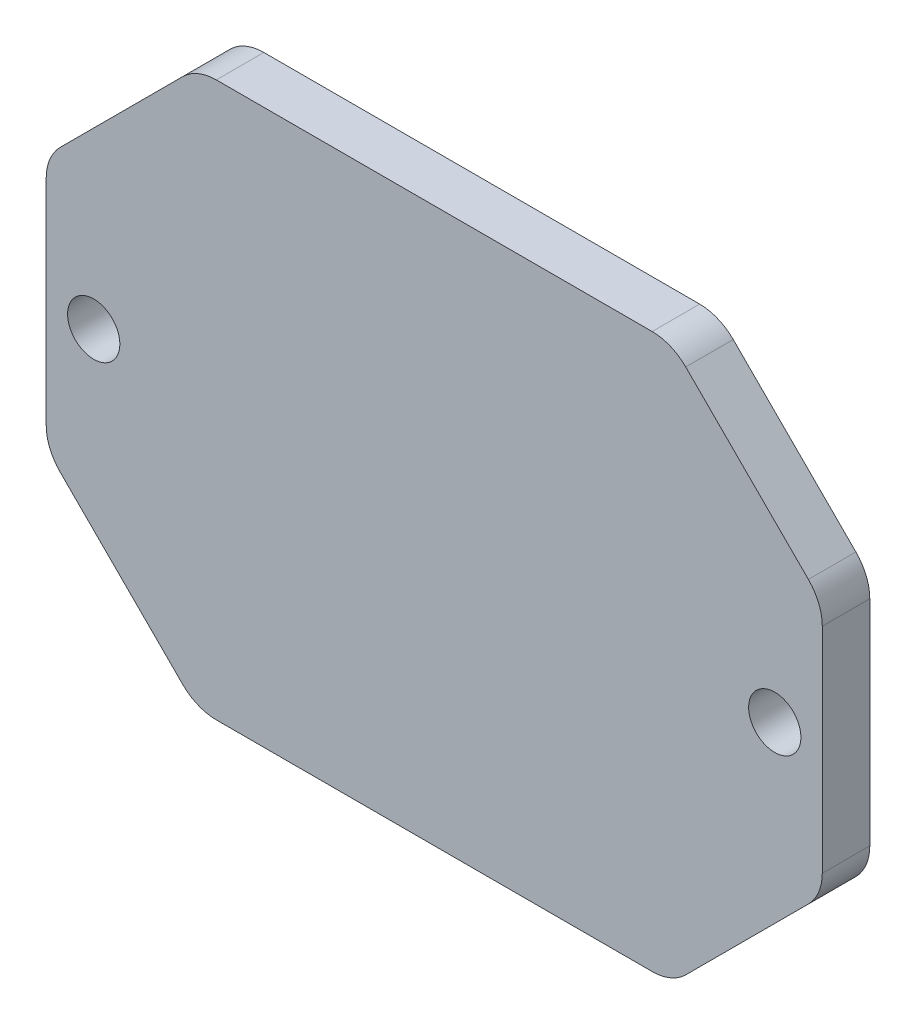
ISO-10303-21;
HEADER;
FILE_DESCRIPTION(('STEP AP214'),'2;1');
FILE_NAME('part.step','',(''),(''),'','','');
FILE_SCHEMA(('AUTOMOTIVE_DESIGN { 1 0 10303 214 1 1 1 1 }'));
ENDSEC;
DATA;
#1=APPLICATION_CONTEXT('core data for automotive mechanical design processes');
#2=APPLICATION_PROTOCOL_DEFINITION('international standard','automotive_design',2000,#1);
#3=PRODUCT_CONTEXT('',#1,'mechanical');
#4=PRODUCT('Part','Part','',(#3));
#5=PRODUCT_RELATED_PRODUCT_CATEGORY('part','',(#4));
#6=PRODUCT_DEFINITION_FORMATION('','',#4);
#7=PRODUCT_DEFINITION_CONTEXT('part definition',#1,'design');
#8=PRODUCT_DEFINITION('design','',#6,#7);
#9=PRODUCT_DEFINITION_SHAPE('','',#8);
#10=(LENGTH_UNIT() NAMED_UNIT(*) SI_UNIT(.MILLI.,.METRE.));
#11=(NAMED_UNIT(*) PLANE_ANGLE_UNIT() SI_UNIT($,.RADIAN.));
#12=(NAMED_UNIT(*) SI_UNIT($,.STERADIAN.) SOLID_ANGLE_UNIT());
#13=UNCERTAINTY_MEASURE_WITH_UNIT(LENGTH_MEASURE(1.E-05),#10,'distance_accuracy_value','');
#14=(GEOMETRIC_REPRESENTATION_CONTEXT(3) GLOBAL_UNCERTAINTY_ASSIGNED_CONTEXT((#13)) GLOBAL_UNIT_ASSIGNED_CONTEXT((#10,
#11,#12)) REPRESENTATION_CONTEXT('',''));
#15=CARTESIAN_POINT('',(0.,0.,0.));
#16=DIRECTION('',(0.,0.,1.));
#17=DIRECTION('',(1.,0.,0.));
#18=AXIS2_PLACEMENT_3D('',#15,#16,#17);
#19=CARTESIAN_POINT('',(24.5,17.4980916030534,3.));
#20=DIRECTION('',(-1.,0.,0.));
#21=DIRECTION('',(0.,-1.,0.));
#22=AXIS2_PLACEMENT_3D('',#19,#20,#21);
#23=PLANE('',#22);
#24=DIRECTION('',(0.,1.,0.));
#25=VECTOR('',#24,1.);
#26=CARTESIAN_POINT('',(24.5,17.4980916030534,3.));
#27=LINE('',#26,#25);
#28=CARTESIAN_POINT('',(24.5,-6.75545091593416,3.));
#29=VERTEX_POINT('',#28);
#30=CARTESIAN_POINT('',(24.5,6.75545091593414,3.));
#31=VERTEX_POINT('',#30);
#32=EDGE_CURVE('E269',#29,#31,#27,.T.);
#33=ORIENTED_EDGE('',*,*,#32,.F.);
#34=DIRECTION('',(0.,0.,1.));
#35=VECTOR('',#34,1.);
#36=CARTESIAN_POINT('',(24.5,-6.75545091593416,0.));
#37=LINE('',#36,#35);
#38=CARTESIAN_POINT('',(24.5,-6.75545091593416,0.));
#39=VERTEX_POINT('',#38);
#40=EDGE_CURVE('E224',#29,#39,#37,.F.);
#41=ORIENTED_EDGE('',*,*,#40,.T.);
#42=DIRECTION('',(0.,1.,0.));
#43=VECTOR('',#42,1.);
#44=CARTESIAN_POINT('',(24.5,17.4980916030534,0.));
#45=LINE('',#44,#43);
#46=CARTESIAN_POINT('',(24.5,6.75545091593414,0.));
#47=VERTEX_POINT('',#46);
#48=EDGE_CURVE('E291',#39,#47,#45,.T.);
#49=ORIENTED_EDGE('',*,*,#48,.T.);
#50=DIRECTION('',(0.,0.,-1.));
#51=VECTOR('',#50,1.);
#52=CARTESIAN_POINT('',(24.5,6.75545091593414,3.));
#53=LINE('',#52,#51);
#54=EDGE_CURVE('E221',#47,#31,#53,.F.);
#55=ORIENTED_EDGE('',*,*,#54,.T.);
#56=EDGE_LOOP('',(#33,#41,#49,#55));
#57=FACE_BOUND('',#56,.T.);
#58=ADVANCED_FACE('F36',(#57),#23,.F.);
#59=CARTESIAN_POINT('',(-24.5,17.4980916030534,3.));
#60=DIRECTION('',(0.,-1.,0.));
#61=DIRECTION('',(0.,0.,-1.));
#62=AXIS2_PLACEMENT_3D('',#59,#60,#61);
#63=PLANE('',#62);
#64=DIRECTION('',(-1.,0.,0.));
#65=VECTOR('',#64,1.);
#66=CARTESIAN_POINT('',(-24.5,17.4980916030534,3.));
#67=LINE('',#66,#65);
#68=CARTESIAN_POINT('',(13.7573593128807,17.4980916030534,3.));
#69=VERTEX_POINT('',#68);
#70=CARTESIAN_POINT('',(-13.7573593128807,17.4980916030534,3.));
#71=VERTEX_POINT('',#70);
#72=EDGE_CURVE('E173',#69,#71,#67,.T.);
#73=ORIENTED_EDGE('',*,*,#72,.F.);
#74=DIRECTION('',(0.,0.,1.));
#75=VECTOR('',#74,1.);
#76=CARTESIAN_POINT('',(13.7573593128807,17.4980916030534,0.));
#77=LINE('',#76,#75);
#78=CARTESIAN_POINT('',(13.7573593128807,17.4980916030534,0.));
#79=VERTEX_POINT('',#78);
#80=EDGE_CURVE('E234',#69,#79,#77,.F.);
#81=ORIENTED_EDGE('',*,*,#80,.T.);
#82=DIRECTION('',(-1.,0.,0.));
#83=VECTOR('',#82,1.);
#84=CARTESIAN_POINT('',(-24.5,17.4980916030534,0.));
#85=LINE('',#84,#83);
#86=CARTESIAN_POINT('',(-13.7573593128807,17.4980916030534,0.));
#87=VERTEX_POINT('',#86);
#88=EDGE_CURVE('E274',#79,#87,#85,.T.);
#89=ORIENTED_EDGE('',*,*,#88,.T.);
#90=DIRECTION('',(0.,0.,-1.));
#91=VECTOR('',#90,1.);
#92=CARTESIAN_POINT('',(-13.7573593128807,17.4980916030534,3.));
#93=LINE('',#92,#91);
#94=EDGE_CURVE('E231',#87,#71,#93,.F.);
#95=ORIENTED_EDGE('',*,*,#94,.T.);
#96=EDGE_LOOP('',(#73,#81,#89,#95));
#97=FACE_BOUND('',#96,.T.);
#98=ADVANCED_FACE('F299',(#97),#63,.F.);
#99=CARTESIAN_POINT('',(-24.5,17.4980916030534,3.));
#100=DIRECTION('',(1.,0.,0.));
#101=DIRECTION('',(0.,1.,0.));
#102=AXIS2_PLACEMENT_3D('',#99,#100,#101);
#103=PLANE('',#102);
#104=DIRECTION('',(0.,-1.,0.));
#105=VECTOR('',#104,1.);
#106=CARTESIAN_POINT('',(-24.5,17.4980916030534,0.));
#107=LINE('',#106,#105);
#108=CARTESIAN_POINT('',(-24.5,6.75545091593416,0.));
#109=VERTEX_POINT('',#108);
#110=CARTESIAN_POINT('',(-24.5,-6.75545091593414,0.));
#111=VERTEX_POINT('',#110);
#112=EDGE_CURVE('E270',#109,#111,#107,.T.);
#113=ORIENTED_EDGE('',*,*,#112,.T.);
#114=DIRECTION('',(0.,0.,-1.));
#115=VECTOR('',#114,1.);
#116=CARTESIAN_POINT('',(-24.5,-6.75545091593414,3.));
#117=LINE('',#116,#115);
#118=CARTESIAN_POINT('',(-24.5,-6.75545091593414,3.));
#119=VERTEX_POINT('',#118);
#120=EDGE_CURVE('E162',#111,#119,#117,.F.);
#121=ORIENTED_EDGE('',*,*,#120,.T.);
#122=DIRECTION('',(0.,-1.,0.));
#123=VECTOR('',#122,1.);
#124=CARTESIAN_POINT('',(-24.5,17.4980916030534,3.));
#125=LINE('',#124,#123);
#126=CARTESIAN_POINT('',(-24.5,6.75545091593416,3.));
#127=VERTEX_POINT('',#126);
#128=EDGE_CURVE('E155',#127,#119,#125,.T.);
#129=ORIENTED_EDGE('',*,*,#128,.F.);
#130=DIRECTION('',(0.,0.,1.));
#131=VECTOR('',#130,1.);
#132=CARTESIAN_POINT('',(-24.5,6.75545091593416,0.));
#133=LINE('',#132,#131);
#134=EDGE_CURVE('E169',#127,#109,#133,.F.);
#135=ORIENTED_EDGE('',*,*,#134,.T.);
#136=EDGE_LOOP('',(#113,#121,#129,#135));
#137=FACE_BOUND('',#136,.T.);
#138=ADVANCED_FACE('F168',(#137),#103,.F.);
#139=CARTESIAN_POINT('',(-24.5,-17.4980916030534,3.));
#140=DIRECTION('',(0.,1.,0.));
#141=DIRECTION('',(0.,0.,1.));
#142=AXIS2_PLACEMENT_3D('',#139,#140,#141);
#143=PLANE('',#142);
#144=DIRECTION('',(1.,0.,0.));
#145=VECTOR('',#144,1.);
#146=CARTESIAN_POINT('',(-24.5,-17.4980916030534,3.));
#147=LINE('',#146,#145);
#148=CARTESIAN_POINT('',(-13.7573593128807,-17.4980916030534,3.));
#149=VERTEX_POINT('',#148);
#150=CARTESIAN_POINT('',(13.7573593128807,-17.4980916030534,3.));
#151=VERTEX_POINT('',#150);
#152=EDGE_CURVE('E172',#149,#151,#147,.T.);
#153=ORIENTED_EDGE('',*,*,#152,.F.);
#154=DIRECTION('',(0.,0.,1.));
#155=VECTOR('',#154,1.);
#156=CARTESIAN_POINT('',(-13.7573593128807,-17.4980916030534,0.));
#157=LINE('',#156,#155);
#158=CARTESIAN_POINT('',(-13.7573593128807,-17.4980916030534,0.));
#159=VERTEX_POINT('',#158);
#160=EDGE_CURVE('E215',#149,#159,#157,.F.);
#161=ORIENTED_EDGE('',*,*,#160,.T.);
#162=DIRECTION('',(1.,0.,0.));
#163=VECTOR('',#162,1.);
#164=CARTESIAN_POINT('',(-24.5,-17.4980916030534,0.));
#165=LINE('',#164,#163);
#166=CARTESIAN_POINT('',(13.7573593128807,-17.4980916030534,0.));
#167=VERTEX_POINT('',#166);
#168=EDGE_CURVE('E265',#159,#167,#165,.T.);
#169=ORIENTED_EDGE('',*,*,#168,.T.);
#170=DIRECTION('',(0.,0.,-1.));
#171=VECTOR('',#170,1.);
#172=CARTESIAN_POINT('',(13.7573593128807,-17.4980916030534,3.));
#173=LINE('',#172,#171);
#174=EDGE_CURVE('E212',#167,#151,#173,.F.);
#175=ORIENTED_EDGE('',*,*,#174,.T.);
#176=EDGE_LOOP('',(#153,#161,#169,#175));
#177=FACE_BOUND('',#176,.T.);
#178=ADVANCED_FACE('F264',(#177),#143,.F.);
#179=CARTESIAN_POINT('',(0.,0.,3.));
#180=DIRECTION('',(0.,0.,1.));
#181=DIRECTION('',(1.,0.,0.));
#182=AXIS2_PLACEMENT_3D('',#179,#180,#181);
#183=PLANE('',#182);
#184=CARTESIAN_POINT('',(-21.5,0.,3.));
#185=DIRECTION('',(0.,0.,1.));
#186=DIRECTION('',(1.,0.,0.));
#187=AXIS2_PLACEMENT_3D('',#184,#185,#186);
#188=CIRCLE('',#187,1.65);
#189=CARTESIAN_POINT('',(-19.85,0.,3.));
#190=VERTEX_POINT('',#189);
#191=EDGE_CURVE('E312',#190,#190,#188,.T.);
#192=ORIENTED_EDGE('',*,*,#191,.F.);
#193=EDGE_LOOP('',(#192));
#194=FACE_BOUND('',#193,.T.);
#195=CARTESIAN_POINT('',(21.5,0.,3.));
#196=DIRECTION('',(0.,0.,1.));
#197=DIRECTION('',(1.,0.,0.));
#198=AXIS2_PLACEMENT_3D('',#195,#196,#197);
#199=CIRCLE('',#198,1.65);
#200=CARTESIAN_POINT('',(23.15,0.,3.));
#201=VERTEX_POINT('',#200);
#202=EDGE_CURVE('E306',#201,#201,#199,.T.);
#203=ORIENTED_EDGE('',*,*,#202,.F.);
#204=EDGE_LOOP('',(#203));
#205=FACE_BOUND('',#204,.T.);
#206=ORIENTED_EDGE('',*,*,#128,.T.);
#207=CARTESIAN_POINT('',(-21.5,-6.75545091593414,3.));
#208=DIRECTION('',(0.,0.,1.));
#209=DIRECTION('',(1.,0.,0.));
#210=AXIS2_PLACEMENT_3D('',#207,#208,#209);
#211=CIRCLE('',#210,3.);
#212=CARTESIAN_POINT('',(-23.6213203435596,-8.87677125949378,3.));
#213=VERTEX_POINT('',#212);
#214=EDGE_CURVE('E193',#119,#213,#211,.T.);
#215=ORIENTED_EDGE('',*,*,#214,.T.);
#216=DIRECTION('',(-0.707106781186546,0.707106781186549,0.));
#217=VECTOR('',#216,1.);
#218=CARTESIAN_POINT('',(-16.2490458015267,-16.2490458015267,3.));
#219=LINE('',#218,#217);
#220=CARTESIAN_POINT('',(-15.8786796564404,-16.6194119466131,3.));
#221=VERTEX_POINT('',#220);
#222=EDGE_CURVE('E178',#213,#221,#219,.F.);
#223=ORIENTED_EDGE('',*,*,#222,.T.);
#224=CARTESIAN_POINT('',(-13.7573593128807,-14.4980916030534,3.));
#225=DIRECTION('',(0.,0.,1.));
#226=DIRECTION('',(1.,0.,0.));
#227=AXIS2_PLACEMENT_3D('',#224,#225,#226);
#228=CIRCLE('',#227,3.);
#229=EDGE_CURVE('E191',#221,#149,#228,.T.);
#230=ORIENTED_EDGE('',*,*,#229,.T.);
#231=ORIENTED_EDGE('',*,*,#152,.T.);
#232=CARTESIAN_POINT('',(13.7573593128807,-14.4980916030534,3.));
#233=DIRECTION('',(0.,0.,1.));
#234=DIRECTION('',(1.,0.,0.));
#235=AXIS2_PLACEMENT_3D('',#232,#233,#234);
#236=CIRCLE('',#235,3.);
#237=CARTESIAN_POINT('',(15.8786796564403,-16.6194119466131,3.));
#238=VERTEX_POINT('',#237);
#239=EDGE_CURVE('E189',#151,#238,#236,.T.);
#240=ORIENTED_EDGE('',*,*,#239,.T.);
#241=DIRECTION('',(-0.707106781186549,-0.707106781186546,0.));
#242=VECTOR('',#241,1.);
#243=CARTESIAN_POINT('',(16.2490458015267,-16.2490458015267,3.));
#244=LINE('',#243,#242);
#245=CARTESIAN_POINT('',(23.6213203435596,-8.87677125949381,3.));
#246=VERTEX_POINT('',#245);
#247=EDGE_CURVE('E247',#238,#246,#244,.F.);
#248=ORIENTED_EDGE('',*,*,#247,.T.);
#249=CARTESIAN_POINT('',(21.5,-6.75545091593416,3.));
#250=DIRECTION('',(0.,0.,1.));
#251=DIRECTION('',(1.,0.,0.));
#252=AXIS2_PLACEMENT_3D('',#249,#250,#251);
#253=CIRCLE('',#252,3.);
#254=EDGE_CURVE('E187',#246,#29,#253,.T.);
#255=ORIENTED_EDGE('',*,*,#254,.T.);
#256=ORIENTED_EDGE('',*,*,#32,.T.);
#257=CARTESIAN_POINT('',(21.5,6.75545091593414,3.));
#258=DIRECTION('',(0.,0.,1.));
#259=DIRECTION('',(1.,0.,0.));
#260=AXIS2_PLACEMENT_3D('',#257,#258,#259);
#261=CIRCLE('',#260,3.);
#262=CARTESIAN_POINT('',(23.6213203435596,8.87677125949378,3.));
#263=VERTEX_POINT('',#262);
#264=EDGE_CURVE('E185',#31,#263,#261,.T.);
#265=ORIENTED_EDGE('',*,*,#264,.T.);
#266=DIRECTION('',(0.707106781186547,-0.707106781186549,0.));
#267=VECTOR('',#266,1.);
#268=CARTESIAN_POINT('',(16.2490458015267,16.2490458015267,3.));
#269=LINE('',#268,#267);
#270=CARTESIAN_POINT('',(15.8786796564404,16.6194119466131,3.));
#271=VERTEX_POINT('',#270);
#272=EDGE_CURVE('E243',#263,#271,#269,.F.);
#273=ORIENTED_EDGE('',*,*,#272,.T.);
#274=CARTESIAN_POINT('',(13.7573593128807,14.4980916030534,3.));
#275=DIRECTION('',(0.,0.,1.));
#276=DIRECTION('',(1.,0.,0.));
#277=AXIS2_PLACEMENT_3D('',#274,#275,#276);
#278=CIRCLE('',#277,3.);
#279=EDGE_CURVE('E183',#271,#69,#278,.T.);
#280=ORIENTED_EDGE('',*,*,#279,.T.);
#281=ORIENTED_EDGE('',*,*,#72,.T.);
#282=CARTESIAN_POINT('',(-13.7573593128807,14.4980916030534,3.));
#283=DIRECTION('',(0.,0.,1.));
#284=DIRECTION('',(1.,0.,0.));
#285=AXIS2_PLACEMENT_3D('',#282,#283,#284);
#286=CIRCLE('',#285,3.);
#287=CARTESIAN_POINT('',(-15.8786796564403,16.6194119466131,3.));
#288=VERTEX_POINT('',#287);
#289=EDGE_CURVE('E161',#71,#288,#286,.T.);
#290=ORIENTED_EDGE('',*,*,#289,.T.);
#291=DIRECTION('',(0.707106781186549,0.707106781186546,0.));
#292=VECTOR('',#291,1.);
#293=CARTESIAN_POINT('',(-16.2490458015267,16.2490458015267,3.));
#294=LINE('',#293,#292);
#295=CARTESIAN_POINT('',(-23.6213203435596,8.87677125949381,3.));
#296=VERTEX_POINT('',#295);
#297=EDGE_CURVE('E157',#288,#296,#294,.F.);
#298=ORIENTED_EDGE('',*,*,#297,.T.);
#299=CARTESIAN_POINT('',(-21.5,6.75545091593416,3.));
#300=DIRECTION('',(0.,0.,1.));
#301=DIRECTION('',(1.,0.,0.));
#302=AXIS2_PLACEMENT_3D('',#299,#300,#301);
#303=CIRCLE('',#302,3.);
#304=EDGE_CURVE('E152',#296,#127,#303,.T.);
#305=ORIENTED_EDGE('',*,*,#304,.T.);
#306=EDGE_LOOP('',(#206,#215,#223,#230,#231,#240,#248,#255,#256,#265,#273,#280,#281,#290,#298,#305));
#307=FACE_BOUND('',#306,.T.);
#308=ADVANCED_FACE('F154',(#194,#205,#307),#183,.T.);
#309=CARTESIAN_POINT('',(0.,0.,0.));
#310=DIRECTION('',(0.,0.,1.));
#311=DIRECTION('',(1.,0.,0.));
#312=AXIS2_PLACEMENT_3D('',#309,#310,#311);
#313=PLANE('',#312);
#314=CARTESIAN_POINT('',(-21.5,0.,0.));
#315=DIRECTION('',(0.,0.,1.));
#316=DIRECTION('',(1.,0.,0.));
#317=AXIS2_PLACEMENT_3D('',#314,#315,#316);
#318=CIRCLE('',#317,1.65);
#319=CARTESIAN_POINT('',(-19.85,0.,0.));
#320=VERTEX_POINT('',#319);
#321=EDGE_CURVE('E293',#320,#320,#318,.T.);
#322=ORIENTED_EDGE('',*,*,#321,.T.);
#323=EDGE_LOOP('',(#322));
#324=FACE_BOUND('',#323,.T.);
#325=CARTESIAN_POINT('',(21.5,0.,0.));
#326=DIRECTION('',(0.,0.,1.));
#327=DIRECTION('',(1.,0.,0.));
#328=AXIS2_PLACEMENT_3D('',#325,#326,#327);
#329=CIRCLE('',#328,1.65);
#330=CARTESIAN_POINT('',(23.15,0.,0.));
#331=VERTEX_POINT('',#330);
#332=EDGE_CURVE('E309',#331,#331,#329,.T.);
#333=ORIENTED_EDGE('',*,*,#332,.T.);
#334=EDGE_LOOP('',(#333));
#335=FACE_BOUND('',#334,.T.);
#336=DIRECTION('',(0.707106781186546,-0.707106781186549,0.));
#337=VECTOR('',#336,1.);
#338=CARTESIAN_POINT('',(-15.,-17.4980916030534,0.));
#339=LINE('',#338,#337);
#340=CARTESIAN_POINT('',(-15.8786796564404,-16.6194119466131,0.));
#341=VERTEX_POINT('',#340);
#342=CARTESIAN_POINT('',(-23.6213203435596,-8.87677125949377,0.));
#343=VERTEX_POINT('',#342);
#344=EDGE_CURVE('E244',#341,#343,#339,.F.);
#345=ORIENTED_EDGE('',*,*,#344,.T.);
#346=CARTESIAN_POINT('',(-21.5,-6.75545091593414,0.));
#347=DIRECTION('',(0.,0.,1.));
#348=DIRECTION('',(1.,0.,0.));
#349=AXIS2_PLACEMENT_3D('',#346,#347,#348);
#350=CIRCLE('',#349,3.);
#351=EDGE_CURVE('E210',#343,#111,#350,.F.);
#352=ORIENTED_EDGE('',*,*,#351,.T.);
#353=ORIENTED_EDGE('',*,*,#112,.F.);
#354=CARTESIAN_POINT('',(-21.5,6.75545091593416,0.));
#355=DIRECTION('',(0.,0.,1.));
#356=DIRECTION('',(1.,0.,0.));
#357=AXIS2_PLACEMENT_3D('',#354,#355,#356);
#358=CIRCLE('',#357,3.);
#359=CARTESIAN_POINT('',(-23.6213203435596,8.87677125949381,0.));
#360=VERTEX_POINT('',#359);
#361=EDGE_CURVE('E175',#109,#360,#358,.F.);
#362=ORIENTED_EDGE('',*,*,#361,.T.);
#363=DIRECTION('',(-0.707106781186549,-0.707106781186546,0.));
#364=VECTOR('',#363,1.);
#365=CARTESIAN_POINT('',(-24.5,7.99809160305345,0.));
#366=LINE('',#365,#364);
#367=CARTESIAN_POINT('',(-15.8786796564403,16.6194119466131,0.));
#368=VERTEX_POINT('',#367);
#369=EDGE_CURVE('E241',#360,#368,#366,.F.);
#370=ORIENTED_EDGE('',*,*,#369,.T.);
#371=CARTESIAN_POINT('',(-13.7573593128807,14.4980916030534,0.));
#372=DIRECTION('',(0.,0.,1.));
#373=DIRECTION('',(1.,0.,0.));
#374=AXIS2_PLACEMENT_3D('',#371,#372,#373);
#375=CIRCLE('',#374,3.);
#376=EDGE_CURVE('E200',#368,#87,#375,.F.);
#377=ORIENTED_EDGE('',*,*,#376,.T.);
#378=ORIENTED_EDGE('',*,*,#88,.F.);
#379=CARTESIAN_POINT('',(13.7573593128807,14.4980916030534,0.));
#380=DIRECTION('',(0.,0.,1.));
#381=DIRECTION('',(1.,0.,0.));
#382=AXIS2_PLACEMENT_3D('',#379,#380,#381);
#383=CIRCLE('',#382,3.);
#384=CARTESIAN_POINT('',(15.8786796564404,16.6194119466131,0.));
#385=VERTEX_POINT('',#384);
#386=EDGE_CURVE('E202',#79,#385,#383,.F.);
#387=ORIENTED_EDGE('',*,*,#386,.T.);
#388=DIRECTION('',(-0.707106781186547,0.707106781186549,0.));
#389=VECTOR('',#388,1.);
#390=CARTESIAN_POINT('',(15.,17.4980916030534,0.));
#391=LINE('',#390,#389);
#392=CARTESIAN_POINT('',(23.6213203435596,8.87677125949377,0.));
#393=VERTEX_POINT('',#392);
#394=EDGE_CURVE('E278',#385,#393,#391,.F.);
#395=ORIENTED_EDGE('',*,*,#394,.T.);
#396=CARTESIAN_POINT('',(21.5,6.75545091593414,0.));
#397=DIRECTION('',(0.,0.,1.));
#398=DIRECTION('',(1.,0.,0.));
#399=AXIS2_PLACEMENT_3D('',#396,#397,#398);
#400=CIRCLE('',#399,3.);
#401=EDGE_CURVE('E204',#393,#47,#400,.F.);
#402=ORIENTED_EDGE('',*,*,#401,.T.);
#403=ORIENTED_EDGE('',*,*,#48,.F.);
#404=CARTESIAN_POINT('',(21.5,-6.75545091593416,0.));
#405=DIRECTION('',(0.,0.,1.));
#406=DIRECTION('',(1.,0.,0.));
#407=AXIS2_PLACEMENT_3D('',#404,#405,#406);
#408=CIRCLE('',#407,3.);
#409=CARTESIAN_POINT('',(23.6213203435596,-8.87677125949381,0.));
#410=VERTEX_POINT('',#409);
#411=EDGE_CURVE('E206',#39,#410,#408,.F.);
#412=ORIENTED_EDGE('',*,*,#411,.T.);
#413=DIRECTION('',(0.707106781186549,0.707106781186546,0.));
#414=VECTOR('',#413,1.);
#415=CARTESIAN_POINT('',(24.5,-7.99809160305345,0.));
#416=LINE('',#415,#414);
#417=CARTESIAN_POINT('',(15.8786796564403,-16.6194119466131,0.));
#418=VERTEX_POINT('',#417);
#419=EDGE_CURVE('E250',#410,#418,#416,.F.);
#420=ORIENTED_EDGE('',*,*,#419,.T.);
#421=CARTESIAN_POINT('',(13.7573593128807,-14.4980916030534,0.));
#422=DIRECTION('',(0.,0.,1.));
#423=DIRECTION('',(1.,0.,0.));
#424=AXIS2_PLACEMENT_3D('',#421,#422,#423);
#425=CIRCLE('',#424,3.);
#426=EDGE_CURVE('E51',#418,#167,#425,.F.);
#427=ORIENTED_EDGE('',*,*,#426,.T.);
#428=ORIENTED_EDGE('',*,*,#168,.F.);
#429=CARTESIAN_POINT('',(-13.7573593128807,-14.4980916030534,0.));
#430=DIRECTION('',(0.,0.,1.));
#431=DIRECTION('',(1.,0.,0.));
#432=AXIS2_PLACEMENT_3D('',#429,#430,#431);
#433=CIRCLE('',#432,3.);
#434=EDGE_CURVE('E59',#159,#341,#433,.F.);
#435=ORIENTED_EDGE('',*,*,#434,.T.);
#436=EDGE_LOOP('',(#345,#352,#353,#362,#370,#377,#378,#387,#395,#402,#403,#412,#420,#427,#428,#435));
#437=FACE_BOUND('',#436,.T.);
#438=ADVANCED_FACE('F267',(#324,#335,#437),#313,.F.);
#439=CARTESIAN_POINT('',(-24.5,7.99809160305345,3.));
#440=DIRECTION('',(0.707106781186546,-0.707106781186549,0.));
#441=DIRECTION('',(0.,0.,-1.));
#442=AXIS2_PLACEMENT_3D('',#439,#440,#441);
#443=PLANE('',#442);
#444=ORIENTED_EDGE('',*,*,#297,.F.);
#445=DIRECTION('',(0.,0.,1.));
#446=VECTOR('',#445,1.);
#447=CARTESIAN_POINT('',(-15.8786796564403,16.6194119466131,0.));
#448=LINE('',#447,#446);
#449=EDGE_CURVE('E11',#288,#368,#448,.F.);
#450=ORIENTED_EDGE('',*,*,#449,.T.);
#451=ORIENTED_EDGE('',*,*,#369,.F.);
#452=DIRECTION('',(0.,0.,-1.));
#453=VECTOR('',#452,1.);
#454=CARTESIAN_POINT('',(-23.6213203435596,8.87677125949381,3.));
#455=LINE('',#454,#453);
#456=EDGE_CURVE('E44',#360,#296,#455,.F.);
#457=ORIENTED_EDGE('',*,*,#456,.T.);
#458=EDGE_LOOP('',(#444,#450,#451,#457));
#459=FACE_BOUND('',#458,.T.);
#460=ADVANCED_FACE('F238',(#459),#443,.F.);
#461=CARTESIAN_POINT('',(-15.,-17.4980916030534,3.));
#462=DIRECTION('',(0.707106781186549,0.707106781186546,0.));
#463=DIRECTION('',(0.,0.,-1.));
#464=AXIS2_PLACEMENT_3D('',#461,#462,#463);
#465=PLANE('',#464);
#466=ORIENTED_EDGE('',*,*,#222,.F.);
#467=DIRECTION('',(0.,0.,1.));
#468=VECTOR('',#467,1.);
#469=CARTESIAN_POINT('',(-23.6213203435596,-8.87677125949378,0.));
#470=LINE('',#469,#468);
#471=EDGE_CURVE('E197',#213,#343,#470,.F.);
#472=ORIENTED_EDGE('',*,*,#471,.T.);
#473=ORIENTED_EDGE('',*,*,#344,.F.);
#474=DIRECTION('',(0.,0.,-1.));
#475=VECTOR('',#474,1.);
#476=CARTESIAN_POINT('',(-15.8786796564404,-16.6194119466131,3.));
#477=LINE('',#476,#475);
#478=EDGE_CURVE('E195',#341,#221,#477,.F.);
#479=ORIENTED_EDGE('',*,*,#478,.T.);
#480=EDGE_LOOP('',(#466,#472,#473,#479));
#481=FACE_BOUND('',#480,.T.);
#482=ADVANCED_FACE('F355',(#481),#465,.F.);
#483=CARTESIAN_POINT('',(24.5,-7.99809160305345,3.));
#484=DIRECTION('',(-0.707106781186546,0.707106781186549,0.));
#485=DIRECTION('',(0.,0.,-1.));
#486=AXIS2_PLACEMENT_3D('',#483,#484,#485);
#487=PLANE('',#486);
#488=ORIENTED_EDGE('',*,*,#247,.F.);
#489=DIRECTION('',(0.,0.,1.));
#490=VECTOR('',#489,1.);
#491=CARTESIAN_POINT('',(15.8786796564403,-16.6194119466131,0.));
#492=LINE('',#491,#490);
#493=EDGE_CURVE('E219',#238,#418,#492,.F.);
#494=ORIENTED_EDGE('',*,*,#493,.T.);
#495=ORIENTED_EDGE('',*,*,#419,.F.);
#496=DIRECTION('',(0.,0.,-1.));
#497=VECTOR('',#496,1.);
#498=CARTESIAN_POINT('',(23.6213203435596,-8.87677125949381,3.));
#499=LINE('',#498,#497);
#500=EDGE_CURVE('E217',#410,#246,#499,.F.);
#501=ORIENTED_EDGE('',*,*,#500,.T.);
#502=EDGE_LOOP('',(#488,#494,#495,#501));
#503=FACE_BOUND('',#502,.T.);
#504=ADVANCED_FACE('F361',(#503),#487,.F.);
#505=CARTESIAN_POINT('',(15.,17.4980916030534,3.));
#506=DIRECTION('',(-0.707106781186548,-0.707106781186546,0.));
#507=DIRECTION('',(0.,0.,-1.));
#508=AXIS2_PLACEMENT_3D('',#505,#506,#507);
#509=PLANE('',#508);
#510=ORIENTED_EDGE('',*,*,#272,.F.);
#511=DIRECTION('',(0.,0.,1.));
#512=VECTOR('',#511,1.);
#513=CARTESIAN_POINT('',(23.6213203435596,8.87677125949378,0.));
#514=LINE('',#513,#512);
#515=EDGE_CURVE('E229',#263,#393,#514,.F.);
#516=ORIENTED_EDGE('',*,*,#515,.T.);
#517=ORIENTED_EDGE('',*,*,#394,.F.);
#518=DIRECTION('',(0.,0.,-1.));
#519=VECTOR('',#518,1.);
#520=CARTESIAN_POINT('',(15.8786796564404,16.6194119466131,3.));
#521=LINE('',#520,#519);
#522=EDGE_CURVE('E227',#385,#271,#521,.F.);
#523=ORIENTED_EDGE('',*,*,#522,.T.);
#524=EDGE_LOOP('',(#510,#516,#517,#523));
#525=FACE_BOUND('',#524,.T.);
#526=ADVANCED_FACE('F367',(#525),#509,.F.);
#527=CARTESIAN_POINT('',(-21.5,-6.75545091593414,3.));
#528=DIRECTION('',(0.,0.,1.));
#529=DIRECTION('',(1.,0.,0.));
#530=AXIS2_PLACEMENT_3D('',#527,#528,#529);
#531=CYLINDRICAL_SURFACE('',#530,3.);
#532=ORIENTED_EDGE('',*,*,#351,.F.);
#533=ORIENTED_EDGE('',*,*,#471,.F.);
#534=ORIENTED_EDGE('',*,*,#214,.F.);
#535=ORIENTED_EDGE('',*,*,#120,.F.);
#536=EDGE_LOOP('',(#532,#533,#534,#535));
#537=FACE_BOUND('',#536,.T.);
#538=ADVANCED_FACE('F372',(#537),#531,.T.);
#539=CARTESIAN_POINT('',(-13.7573593128807,-14.4980916030534,3.));
#540=DIRECTION('',(0.,0.,-1.));
#541=DIRECTION('',(-1.,0.,0.));
#542=AXIS2_PLACEMENT_3D('',#539,#540,#541);
#543=CYLINDRICAL_SURFACE('',#542,3.);
#544=ORIENTED_EDGE('',*,*,#229,.F.);
#545=ORIENTED_EDGE('',*,*,#478,.F.);
#546=ORIENTED_EDGE('',*,*,#434,.F.);
#547=ORIENTED_EDGE('',*,*,#160,.F.);
#548=EDGE_LOOP('',(#544,#545,#546,#547));
#549=FACE_BOUND('',#548,.T.);
#550=ADVANCED_FACE('F262',(#549),#543,.T.);
#551=CARTESIAN_POINT('',(13.7573593128807,-14.4980916030534,3.));
#552=DIRECTION('',(0.,0.,1.));
#553=DIRECTION('',(1.,0.,0.));
#554=AXIS2_PLACEMENT_3D('',#551,#552,#553);
#555=CYLINDRICAL_SURFACE('',#554,3.);
#556=ORIENTED_EDGE('',*,*,#426,.F.);
#557=ORIENTED_EDGE('',*,*,#493,.F.);
#558=ORIENTED_EDGE('',*,*,#239,.F.);
#559=ORIENTED_EDGE('',*,*,#174,.F.);
#560=EDGE_LOOP('',(#556,#557,#558,#559));
#561=FACE_BOUND('',#560,.T.);
#562=ADVANCED_FACE('F286',(#561),#555,.T.);
#563=CARTESIAN_POINT('',(21.5,-6.75545091593416,3.));
#564=DIRECTION('',(0.,0.,-1.));
#565=DIRECTION('',(-1.,0.,0.));
#566=AXIS2_PLACEMENT_3D('',#563,#564,#565);
#567=CYLINDRICAL_SURFACE('',#566,3.);
#568=ORIENTED_EDGE('',*,*,#254,.F.);
#569=ORIENTED_EDGE('',*,*,#500,.F.);
#570=ORIENTED_EDGE('',*,*,#411,.F.);
#571=ORIENTED_EDGE('',*,*,#40,.F.);
#572=EDGE_LOOP('',(#568,#569,#570,#571));
#573=FACE_BOUND('',#572,.T.);
#574=ADVANCED_FACE('F381',(#573),#567,.T.);
#575=CARTESIAN_POINT('',(21.5,6.75545091593414,3.));
#576=DIRECTION('',(0.,0.,1.));
#577=DIRECTION('',(1.,0.,0.));
#578=AXIS2_PLACEMENT_3D('',#575,#576,#577);
#579=CYLINDRICAL_SURFACE('',#578,3.);
#580=ORIENTED_EDGE('',*,*,#401,.F.);
#581=ORIENTED_EDGE('',*,*,#515,.F.);
#582=ORIENTED_EDGE('',*,*,#264,.F.);
#583=ORIENTED_EDGE('',*,*,#54,.F.);
#584=EDGE_LOOP('',(#580,#581,#582,#583));
#585=FACE_BOUND('',#584,.T.);
#586=ADVANCED_FACE('F384',(#585),#579,.T.);
#587=CARTESIAN_POINT('',(13.7573593128807,14.4980916030534,3.));
#588=DIRECTION('',(0.,0.,-1.));
#589=DIRECTION('',(-1.,0.,0.));
#590=AXIS2_PLACEMENT_3D('',#587,#588,#589);
#591=CYLINDRICAL_SURFACE('',#590,3.);
#592=ORIENTED_EDGE('',*,*,#279,.F.);
#593=ORIENTED_EDGE('',*,*,#522,.F.);
#594=ORIENTED_EDGE('',*,*,#386,.F.);
#595=ORIENTED_EDGE('',*,*,#80,.F.);
#596=EDGE_LOOP('',(#592,#593,#594,#595));
#597=FACE_BOUND('',#596,.T.);
#598=ADVANCED_FACE('F388',(#597),#591,.T.);
#599=CARTESIAN_POINT('',(-13.7573593128807,14.4980916030534,3.));
#600=DIRECTION('',(0.,0.,1.));
#601=DIRECTION('',(1.,0.,0.));
#602=AXIS2_PLACEMENT_3D('',#599,#600,#601);
#603=CYLINDRICAL_SURFACE('',#602,3.);
#604=ORIENTED_EDGE('',*,*,#376,.F.);
#605=ORIENTED_EDGE('',*,*,#449,.F.);
#606=ORIENTED_EDGE('',*,*,#289,.F.);
#607=ORIENTED_EDGE('',*,*,#94,.F.);
#608=EDGE_LOOP('',(#604,#605,#606,#607));
#609=FACE_BOUND('',#608,.T.);
#610=ADVANCED_FACE('F303',(#609),#603,.T.);
#611=CARTESIAN_POINT('',(-21.5,6.75545091593416,3.));
#612=DIRECTION('',(0.,0.,-1.));
#613=DIRECTION('',(-1.,0.,0.));
#614=AXIS2_PLACEMENT_3D('',#611,#612,#613);
#615=CYLINDRICAL_SURFACE('',#614,3.);
#616=ORIENTED_EDGE('',*,*,#304,.F.);
#617=ORIENTED_EDGE('',*,*,#456,.F.);
#618=ORIENTED_EDGE('',*,*,#361,.F.);
#619=ORIENTED_EDGE('',*,*,#134,.F.);
#620=EDGE_LOOP('',(#616,#617,#618,#619));
#621=FACE_BOUND('',#620,.T.);
#622=ADVANCED_FACE('F38',(#621),#615,.T.);
#623=CARTESIAN_POINT('',(21.5,0.,0.));
#624=DIRECTION('',(0.,0.,1.));
#625=DIRECTION('',(1.,0.,0.));
#626=AXIS2_PLACEMENT_3D('',#623,#624,#625);
#627=CYLINDRICAL_SURFACE('',#626,1.65);
#628=ORIENTED_EDGE('',*,*,#332,.F.);
#629=EDGE_LOOP('',(#628));
#630=FACE_BOUND('',#629,.T.);
#631=ORIENTED_EDGE('',*,*,#202,.T.);
#632=EDGE_LOOP('',(#631));
#633=FACE_BOUND('',#632,.T.);
#634=ADVANCED_FACE('F323',(#630,#633),#627,.F.);
#635=CARTESIAN_POINT('',(-21.5,0.,0.));
#636=DIRECTION('',(0.,0.,1.));
#637=DIRECTION('',(1.,0.,0.));
#638=AXIS2_PLACEMENT_3D('',#635,#636,#637);
#639=CYLINDRICAL_SURFACE('',#638,1.65);
#640=ORIENTED_EDGE('',*,*,#321,.F.);
#641=EDGE_LOOP('',(#640));
#642=FACE_BOUND('',#641,.T.);
#643=ORIENTED_EDGE('',*,*,#191,.T.);
#644=EDGE_LOOP('',(#643));
#645=FACE_BOUND('',#644,.T.);
#646=ADVANCED_FACE('F320',(#642,#645),#639,.F.);
#647=CLOSED_SHELL('',(#58,#98,#138,#178,#308,#438,#460,#482,#504,#526,#538,#550,#562,#574,#586,
#598,#610,#622,#634,#646));
#648=MANIFOLD_SOLID_BREP('B2',#647);
#649=ADVANCED_BREP_SHAPE_REPRESENTATION('',(#18,#648),#14);
#650=SHAPE_DEFINITION_REPRESENTATION(#9,#649);
ENDSEC;
END-ISO-10303-21;
